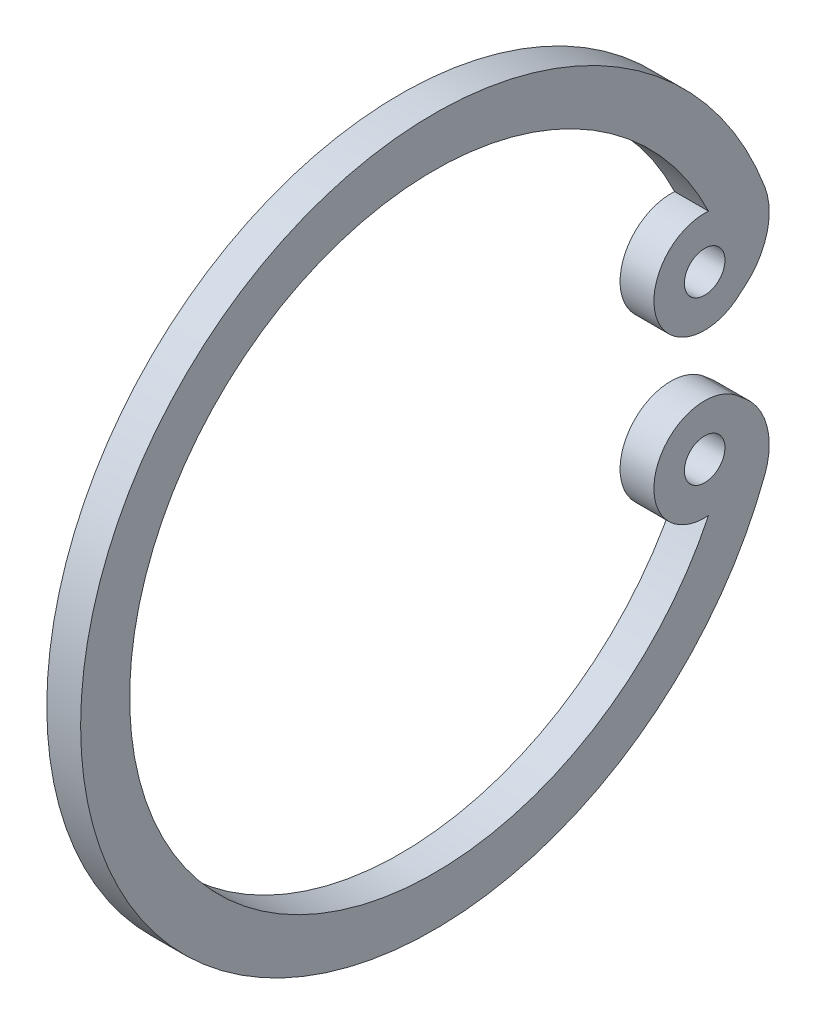
ISO-10303-21;
HEADER;
FILE_DESCRIPTION(('STEP AP214'),'2;1');
FILE_NAME('part.step','',(''),(''),'','','');
FILE_SCHEMA(('AUTOMOTIVE_DESIGN { 1 0 10303 214 1 1 1 1 }'));
ENDSEC;
DATA;
#1=APPLICATION_CONTEXT('core data for automotive mechanical design processes');
#2=APPLICATION_PROTOCOL_DEFINITION('international standard','automotive_design',2000,#1);
#3=PRODUCT_CONTEXT('',#1,'mechanical');
#4=PRODUCT('Part','Part','',(#3));
#5=PRODUCT_RELATED_PRODUCT_CATEGORY('part','',(#4));
#6=PRODUCT_DEFINITION_FORMATION('','',#4);
#7=PRODUCT_DEFINITION_CONTEXT('part definition',#1,'design');
#8=PRODUCT_DEFINITION('design','',#6,#7);
#9=PRODUCT_DEFINITION_SHAPE('','',#8);
#10=(LENGTH_UNIT() NAMED_UNIT(*) SI_UNIT(.MILLI.,.METRE.));
#11=(NAMED_UNIT(*) PLANE_ANGLE_UNIT() SI_UNIT($,.RADIAN.));
#12=(NAMED_UNIT(*) SI_UNIT($,.STERADIAN.) SOLID_ANGLE_UNIT());
#13=UNCERTAINTY_MEASURE_WITH_UNIT(LENGTH_MEASURE(1.E-05),#10,'distance_accuracy_value','');
#14=(GEOMETRIC_REPRESENTATION_CONTEXT(3) GLOBAL_UNCERTAINTY_ASSIGNED_CONTEXT((#13)) GLOBAL_UNIT_ASSIGNED_CONTEXT((#10,
#11,#12)) REPRESENTATION_CONTEXT('',''));
#15=CARTESIAN_POINT('',(0.,0.,0.));
#16=DIRECTION('',(0.,0.,1.));
#17=DIRECTION('',(1.,0.,0.));
#18=AXIS2_PLACEMENT_3D('',#15,#16,#17);
#19=CARTESIAN_POINT('',(18.3611111111111,-0.000162813210468626,9.93971753018335));
#20=DIRECTION('',(1.,0.,0.));
#21=DIRECTION('',(0.,0.,-1.));
#22=AXIS2_PLACEMENT_3D('',#19,#20,#21);
#23=CYLINDRICAL_SURFACE('',#22,2.5000000372529);
#24=CARTESIAN_POINT('',(18.6388888888889,-0.000162813210468626,9.93971753018335));
#25=DIRECTION('',(-1.,0.,0.));
#26=DIRECTION('',(0.,0.,1.));
#27=AXIS2_PLACEMENT_3D('',#24,#25,#26);
#28=CIRCLE('',#27,2.5000000372529);
#29=CARTESIAN_POINT('',(18.6388888888889,-1.08255334468496,7.68618010567962));
#30=VERTEX_POINT('',#29);
#31=CARTESIAN_POINT('',(18.6388888888889,1.08222771826402,7.68618010567962));
#32=VERTEX_POINT('',#31);
#33=EDGE_CURVE('E131',#30,#32,#28,.T.);
#34=ORIENTED_EDGE('',*,*,#33,.F.);
#35=DIRECTION('',(1.,0.,0.));
#36=VECTOR('',#35,1.);
#37=CARTESIAN_POINT('',(18.3611111111111,-1.08255334468496,7.68618010567962));
#38=LINE('',#37,#36);
#39=CARTESIAN_POINT('',(18.3611111111111,-1.08255334468496,7.68618010567962));
#40=VERTEX_POINT('',#39);
#41=EDGE_CURVE('E11',#40,#30,#38,.T.);
#42=ORIENTED_EDGE('',*,*,#41,.F.);
#43=CARTESIAN_POINT('',(18.3611111111111,-0.000162813210468626,9.93971753018335));
#44=DIRECTION('',(-1.,0.,0.));
#45=DIRECTION('',(0.,0.,1.));
#46=AXIS2_PLACEMENT_3D('',#43,#44,#45);
#47=CIRCLE('',#46,2.5000000372529);
#48=CARTESIAN_POINT('',(18.3611111111111,1.08222771826402,7.68618010567962));
#49=VERTEX_POINT('',#48);
#50=EDGE_CURVE('E152',#40,#49,#47,.T.);
#51=ORIENTED_EDGE('',*,*,#50,.T.);
#52=DIRECTION('',(1.,0.,0.));
#53=VECTOR('',#52,1.);
#54=CARTESIAN_POINT('',(18.3611111111111,1.08222771826402,7.68618010567962));
#55=LINE('',#54,#53);
#56=EDGE_CURVE('E37',#49,#32,#55,.T.);
#57=ORIENTED_EDGE('',*,*,#56,.T.);
#58=EDGE_LOOP('',(#34,#42,#51,#57));
#59=FACE_BOUND('',#58,.T.);
#60=ADVANCED_FACE('F34',(#59),#23,.F.);
#61=CARTESIAN_POINT('',(18.3611111111111,-0.666917459563021,7.71771885059295));
#62=DIRECTION('',(1.,0.,0.));
#63=DIRECTION('',(0.,0.,-1.));
#64=AXIS2_PLACEMENT_3D('',#61,#62,#63);
#65=CYLINDRICAL_SURFACE('',#64,0.416830758740048);
#66=CARTESIAN_POINT('',(18.6388888888889,-0.666917459563021,7.71771885059295));
#67=DIRECTION('',(1.,0.,0.));
#68=DIRECTION('',(0.,0.,-1.));
#69=AXIS2_PLACEMENT_3D('',#66,#67,#68);
#70=CIRCLE('',#69,0.416830758740048);
#71=CARTESIAN_POINT('',(18.6388888888889,-0.337229909778591,7.46266199232613));
#72=VERTEX_POINT('',#71);
#73=EDGE_CURVE('E150',#72,#30,#70,.T.);
#74=ORIENTED_EDGE('',*,*,#73,.F.);
#75=DIRECTION('',(1.,0.,0.));
#76=VECTOR('',#75,1.);
#77=CARTESIAN_POINT('',(18.3611111111111,-0.337229909778591,7.46266199232613));
#78=LINE('',#77,#76);
#79=CARTESIAN_POINT('',(18.3611111111111,-0.337229909778591,7.46266199232613));
#80=VERTEX_POINT('',#79);
#81=EDGE_CURVE('E43',#80,#72,#78,.T.);
#82=ORIENTED_EDGE('',*,*,#81,.F.);
#83=CARTESIAN_POINT('',(18.3611111111111,-0.666917459563021,7.71771885059295));
#84=DIRECTION('',(1.,0.,0.));
#85=DIRECTION('',(0.,0.,-1.));
#86=AXIS2_PLACEMENT_3D('',#83,#84,#85);
#87=CIRCLE('',#86,0.416830758740048);
#88=EDGE_CURVE('E121',#80,#40,#87,.T.);
#89=ORIENTED_EDGE('',*,*,#88,.T.);
#90=ORIENTED_EDGE('',*,*,#41,.T.);
#91=EDGE_LOOP('',(#74,#82,#89,#90));
#92=FACE_BOUND('',#91,.T.);
#93=ADVANCED_FACE('F164',(#92),#65,.T.);
#94=CARTESIAN_POINT('',(18.3611111111111,-0.401543008719923,7.38601662561192));
#95=DIRECTION('',(0.,0.766044443118982,-0.642787609686534));
#96=DIRECTION('',(0.,0.642787609686534,0.766044443118982));
#97=AXIS2_PLACEMENT_3D('',#94,#95,#96);
#98=PLANE('',#97);
#99=DIRECTION('',(0.,0.642787609686534,0.766044443118982));
#100=VECTOR('',#99,1.);
#101=CARTESIAN_POINT('',(18.6388888888889,-0.401543008719923,7.38601662561192));
#102=LINE('',#101,#100);
#103=CARTESIAN_POINT('',(18.6388888888889,-0.401543008719923,7.38601662561192));
#104=VERTEX_POINT('',#103);
#105=EDGE_CURVE('E108',#104,#72,#102,.T.);
#106=ORIENTED_EDGE('',*,*,#105,.F.);
#107=DIRECTION('',(1.,0.,0.));
#108=VECTOR('',#107,1.);
#109=CARTESIAN_POINT('',(18.3611111111111,-0.401543008719923,7.38601662561192));
#110=LINE('',#109,#108);
#111=CARTESIAN_POINT('',(18.3611111111111,-0.401543008719923,7.38601662561192));
#112=VERTEX_POINT('',#111);
#113=EDGE_CURVE('E103',#112,#104,#110,.T.);
#114=ORIENTED_EDGE('',*,*,#113,.F.);
#115=DIRECTION('',(0.,0.642787609686534,0.766044443118982));
#116=VECTOR('',#115,1.);
#117=CARTESIAN_POINT('',(18.3611111111111,-0.401543008719923,7.38601662561192));
#118=LINE('',#117,#116);
#119=EDGE_CURVE('E106',#112,#80,#118,.T.);
#120=ORIENTED_EDGE('',*,*,#119,.T.);
#121=ORIENTED_EDGE('',*,*,#81,.T.);
#122=EDGE_LOOP('',(#106,#114,#120,#121));
#123=FACE_BOUND('',#122,.T.);
#124=ADVANCED_FACE('F105',(#123),#98,.T.);
#125=CARTESIAN_POINT('',(18.3611111111111,-0.827123254897134,7.74312085321556));
#126=DIRECTION('',(1.,0.,0.));
#127=DIRECTION('',(0.,0.,-1.));
#128=AXIS2_PLACEMENT_3D('',#125,#126,#127);
#129=CYLINDRICAL_SURFACE('',#128,0.555555555555558);
#130=CARTESIAN_POINT('',(18.6388888888889,-0.827123254897134,7.74312085321556));
#131=DIRECTION('',(1.,0.,0.));
#132=DIRECTION('',(0.,0.,-1.));
#133=AXIS2_PLACEMENT_3D('',#130,#131,#132);
#134=CIRCLE('',#133,0.555555555555558);
#135=CARTESIAN_POINT('',(18.6388888888889,-1.02286333631576,7.22319028493276));
#136=VERTEX_POINT('',#135);
#137=EDGE_CURVE('E147',#136,#104,#134,.T.);
#138=ORIENTED_EDGE('',*,*,#137,.F.);
#139=DIRECTION('',(1.,0.,0.));
#140=VECTOR('',#139,1.);
#141=CARTESIAN_POINT('',(18.3611111111111,-1.02286333631576,7.22319028493276));
#142=LINE('',#141,#140);
#143=CARTESIAN_POINT('',(18.3611111111111,-1.02286333631576,7.22319028493276));
#144=VERTEX_POINT('',#143);
#145=EDGE_CURVE('E113',#144,#136,#142,.T.);
#146=ORIENTED_EDGE('',*,*,#145,.F.);
#147=CARTESIAN_POINT('',(18.3611111111111,-0.827123254897134,7.74312085321556));
#148=DIRECTION('',(1.,0.,0.));
#149=DIRECTION('',(0.,0.,-1.));
#150=AXIS2_PLACEMENT_3D('',#147,#148,#149);
#151=CIRCLE('',#150,0.555555555555558);
#152=EDGE_CURVE('E119',#144,#112,#151,.T.);
#153=ORIENTED_EDGE('',*,*,#152,.T.);
#154=ORIENTED_EDGE('',*,*,#113,.T.);
#155=EDGE_LOOP('',(#138,#146,#153,#154));
#156=FACE_BOUND('',#155,.T.);
#157=ADVANCED_FACE('F123',(#156),#129,.T.);
#158=CARTESIAN_POINT('',(18.3611111111111,-0.000162813210468626,9.93971753018335));
#159=DIRECTION('',(1.,0.,0.));
#160=DIRECTION('',(0.,0.,-1.));
#161=AXIS2_PLACEMENT_3D('',#158,#159,#160);
#162=CYLINDRICAL_SURFACE('',#161,2.90266026846901);
#163=CARTESIAN_POINT('',(18.6388888888889,-0.000162813210468626,9.93971753018335));
#164=DIRECTION('',(1.,0.,0.));
#165=DIRECTION('',(0.,0.,-1.));
#166=AXIS2_PLACEMENT_3D('',#163,#164,#165);
#167=CIRCLE('',#166,2.90266026846901);
#168=CARTESIAN_POINT('',(18.6388888888889,1.0225283518045,7.22318676187813));
#169=VERTEX_POINT('',#168);
#170=EDGE_CURVE('E144',#169,#136,#167,.T.);
#171=ORIENTED_EDGE('',*,*,#170,.F.);
#172=DIRECTION('',(1.,0.,0.));
#173=VECTOR('',#172,1.);
#174=CARTESIAN_POINT('',(18.3611111111111,1.0225283518045,7.22318676187813));
#175=LINE('',#174,#173);
#176=CARTESIAN_POINT('',(18.3611111111111,1.0225283518045,7.22318676187813));
#177=VERTEX_POINT('',#176);
#178=EDGE_CURVE('E156',#177,#169,#175,.T.);
#179=ORIENTED_EDGE('',*,*,#178,.F.);
#180=CARTESIAN_POINT('',(18.3611111111111,-0.000162813210468626,9.93971753018335));
#181=DIRECTION('',(1.,0.,0.));
#182=DIRECTION('',(0.,0.,-1.));
#183=AXIS2_PLACEMENT_3D('',#180,#181,#182);
#184=CIRCLE('',#183,2.90266026846901);
#185=EDGE_CURVE('E124',#177,#144,#184,.T.);
#186=ORIENTED_EDGE('',*,*,#185,.T.);
#187=ORIENTED_EDGE('',*,*,#145,.T.);
#188=EDGE_LOOP('',(#171,#179,#186,#187));
#189=FACE_BOUND('',#188,.T.);
#190=ADVANCED_FACE('F177',(#189),#162,.T.);
#191=CARTESIAN_POINT('',(18.3611111111111,0.826790061480457,7.74311800445706));
#192=DIRECTION('',(1.,0.,0.));
#193=DIRECTION('',(0.,0.,-1.));
#194=AXIS2_PLACEMENT_3D('',#191,#192,#193);
#195=CYLINDRICAL_SURFACE('',#194,0.555555555555555);
#196=CARTESIAN_POINT('',(18.6388888888889,0.826790061480457,7.74311800445706));
#197=DIRECTION('',(1.,0.,0.));
#198=DIRECTION('',(0.,0.,-1.));
#199=AXIS2_PLACEMENT_3D('',#196,#197,#198);
#200=CIRCLE('',#199,0.555555555555555);
#201=CARTESIAN_POINT('',(18.6388888888889,0.401209815303247,7.38601377685343));
#202=VERTEX_POINT('',#201);
#203=EDGE_CURVE('E141',#202,#169,#200,.T.);
#204=ORIENTED_EDGE('',*,*,#203,.F.);
#205=DIRECTION('',(1.,0.,0.));
#206=VECTOR('',#205,1.);
#207=CARTESIAN_POINT('',(18.3611111111111,0.401209815303247,7.38601377685343));
#208=LINE('',#207,#206);
#209=CARTESIAN_POINT('',(18.3611111111111,0.401209815303247,7.38601377685343));
#210=VERTEX_POINT('',#209);
#211=EDGE_CURVE('E158',#210,#202,#208,.T.);
#212=ORIENTED_EDGE('',*,*,#211,.F.);
#213=CARTESIAN_POINT('',(18.3611111111111,0.826790061480457,7.74311800445706));
#214=DIRECTION('',(1.,0.,0.));
#215=DIRECTION('',(0.,0.,-1.));
#216=AXIS2_PLACEMENT_3D('',#213,#214,#215);
#217=CIRCLE('',#216,0.555555555555555);
#218=EDGE_CURVE('E126',#210,#177,#217,.T.);
#219=ORIENTED_EDGE('',*,*,#218,.T.);
#220=ORIENTED_EDGE('',*,*,#178,.T.);
#221=EDGE_LOOP('',(#204,#212,#219,#220));
#222=FACE_BOUND('',#221,.T.);
#223=ADVANCED_FACE('F180',(#222),#195,.T.);
#224=CARTESIAN_POINT('',(18.3611111111111,0.337156289867929,7.46285995798236));
#225=DIRECTION('',(0.,-0.768147331821205,-0.640273126576435));
#226=DIRECTION('',(0.,0.640273126576435,-0.768147331821205));
#227=AXIS2_PLACEMENT_3D('',#224,#225,#226);
#228=PLANE('',#227);
#229=DIRECTION('',(0.,0.640273126576435,-0.768147331821205));
#230=VECTOR('',#229,1.);
#231=CARTESIAN_POINT('',(18.6388888888889,0.337156289867929,7.46285995798236));
#232=LINE('',#231,#230);
#233=CARTESIAN_POINT('',(18.6388888888889,0.337156289867929,7.46285995798236));
#234=VERTEX_POINT('',#233);
#235=EDGE_CURVE('E138',#234,#202,#232,.T.);
#236=ORIENTED_EDGE('',*,*,#235,.F.);
#237=DIRECTION('',(1.,0.,0.));
#238=VECTOR('',#237,1.);
#239=CARTESIAN_POINT('',(18.3611111111111,0.337156289867929,7.46285995798236));
#240=LINE('',#239,#238);
#241=CARTESIAN_POINT('',(18.3611111111111,0.337156289867929,7.46285995798236));
#242=VERTEX_POINT('',#241);
#243=EDGE_CURVE('E159',#242,#234,#240,.T.);
#244=ORIENTED_EDGE('',*,*,#243,.F.);
#245=DIRECTION('',(0.,0.640273126576435,-0.768147331821205));
#246=VECTOR('',#245,1.);
#247=CARTESIAN_POINT('',(18.3611111111111,0.337156289867929,7.46285995798236));
#248=LINE('',#247,#246);
#249=EDGE_CURVE('E226',#242,#210,#248,.T.);
#250=ORIENTED_EDGE('',*,*,#249,.T.);
#251=ORIENTED_EDGE('',*,*,#211,.T.);
#252=EDGE_LOOP('',(#236,#244,#250,#251));
#253=FACE_BOUND('',#252,.T.);
#254=ADVANCED_FACE('F184',(#253),#228,.T.);
#255=CARTESIAN_POINT('',(18.3611111111111,0.666759358402729,7.71775783620726));
#256=DIRECTION('',(1.,0.,0.));
#257=DIRECTION('',(0.,0.,-1.));
#258=AXIS2_PLACEMENT_3D('',#255,#256,#257);
#259=CYLINDRICAL_SURFACE('',#258,0.416666666666666);
#260=CARTESIAN_POINT('',(18.6388888888889,0.666759358402729,7.71775783620726));
#261=DIRECTION('',(1.,0.,0.));
#262=DIRECTION('',(0.,0.,-1.));
#263=AXIS2_PLACEMENT_3D('',#260,#261,#262);
#264=CIRCLE('',#263,0.416666666666666);
#265=EDGE_CURVE('E134',#32,#234,#264,.T.);
#266=ORIENTED_EDGE('',*,*,#265,.F.);
#267=ORIENTED_EDGE('',*,*,#56,.F.);
#268=CARTESIAN_POINT('',(18.3611111111111,0.666759358402729,7.71775783620726));
#269=DIRECTION('',(1.,0.,0.));
#270=DIRECTION('',(0.,0.,-1.));
#271=AXIS2_PLACEMENT_3D('',#268,#269,#270);
#272=CIRCLE('',#271,0.416666666666666);
#273=EDGE_CURVE('E224',#49,#242,#272,.T.);
#274=ORIENTED_EDGE('',*,*,#273,.T.);
#275=ORIENTED_EDGE('',*,*,#243,.T.);
#276=EDGE_LOOP('',(#266,#267,#274,#275));
#277=FACE_BOUND('',#276,.T.);
#278=ADVANCED_FACE('F161',(#277),#259,.T.);
#279=CARTESIAN_POINT('',(18.3611111111111,-0.000162813210468626,9.93971753018335));
#280=DIRECTION('',(-1.,0.,0.));
#281=DIRECTION('',(0.,0.,1.));
#282=AXIS2_PLACEMENT_3D('',#279,#280,#281);
#283=PLANE('',#282);
#284=CARTESIAN_POINT('',(18.3611111111111,0.66653768838861,7.71760813916771));
#285=DIRECTION('',(1.,0.,0.));
#286=DIRECTION('',(0.,0.,1.));
#287=AXIS2_PLACEMENT_3D('',#284,#285,#286);
#288=CIRCLE('',#287,0.166666666666667);
#289=CARTESIAN_POINT('',(18.3611111111111,0.66653768838861,7.88427480583437));
#290=VERTEX_POINT('',#289);
#291=EDGE_CURVE('E211',#290,#290,#288,.T.);
#292=ORIENTED_EDGE('',*,*,#291,.T.);
#293=EDGE_LOOP('',(#292));
#294=FACE_BOUND('',#293,.T.);
#295=CARTESIAN_POINT('',(18.3611111111111,-0.666795644944723,7.71760813916771));
#296=DIRECTION('',(1.,0.,0.));
#297=DIRECTION('',(0.,0.,1.));
#298=AXIS2_PLACEMENT_3D('',#295,#296,#297);
#299=CIRCLE('',#298,0.166666666666667);
#300=CARTESIAN_POINT('',(18.3611111111111,-0.666795644944723,7.88427480583437));
#301=VERTEX_POINT('',#300);
#302=EDGE_CURVE('E135',#301,#301,#299,.T.);
#303=ORIENTED_EDGE('',*,*,#302,.T.);
#304=EDGE_LOOP('',(#303));
#305=FACE_BOUND('',#304,.T.);
#306=ORIENTED_EDGE('',*,*,#50,.F.);
#307=ORIENTED_EDGE('',*,*,#88,.F.);
#308=ORIENTED_EDGE('',*,*,#119,.F.);
#309=ORIENTED_EDGE('',*,*,#152,.F.);
#310=ORIENTED_EDGE('',*,*,#185,.F.);
#311=ORIENTED_EDGE('',*,*,#218,.F.);
#312=ORIENTED_EDGE('',*,*,#249,.F.);
#313=ORIENTED_EDGE('',*,*,#273,.F.);
#314=EDGE_LOOP('',(#306,#307,#308,#309,#310,#311,#312,#313));
#315=FACE_BOUND('',#314,.T.);
#316=ADVANCED_FACE('F117',(#294,#305,#315),#283,.T.);
#317=CARTESIAN_POINT('',(18.6388888888889,-0.000162813210468626,9.93971753018335));
#318=DIRECTION('',(-1.,0.,0.));
#319=DIRECTION('',(0.,0.,1.));
#320=AXIS2_PLACEMENT_3D('',#317,#318,#319);
#321=PLANE('',#320);
#322=CARTESIAN_POINT('',(18.6388888888889,0.66653768838861,7.71760813916771));
#323=DIRECTION('',(1.,0.,0.));
#324=DIRECTION('',(0.,0.,1.));
#325=AXIS2_PLACEMENT_3D('',#322,#323,#324);
#326=CIRCLE('',#325,0.166666666666667);
#327=CARTESIAN_POINT('',(18.6388888888889,0.66653768838861,7.88427480583437));
#328=VERTEX_POINT('',#327);
#329=EDGE_CURVE('E214',#328,#328,#326,.T.);
#330=ORIENTED_EDGE('',*,*,#329,.F.);
#331=EDGE_LOOP('',(#330));
#332=FACE_BOUND('',#331,.T.);
#333=CARTESIAN_POINT('',(18.6388888888889,-0.666795644944723,7.71760813916771));
#334=DIRECTION('',(1.,0.,0.));
#335=DIRECTION('',(0.,0.,1.));
#336=AXIS2_PLACEMENT_3D('',#333,#334,#335);
#337=CIRCLE('',#336,0.166666666666667);
#338=CARTESIAN_POINT('',(18.6388888888889,-0.666795644944723,7.88427480583437));
#339=VERTEX_POINT('',#338);
#340=EDGE_CURVE('E216',#339,#339,#337,.T.);
#341=ORIENTED_EDGE('',*,*,#340,.F.);
#342=EDGE_LOOP('',(#341));
#343=FACE_BOUND('',#342,.T.);
#344=ORIENTED_EDGE('',*,*,#33,.T.);
#345=ORIENTED_EDGE('',*,*,#265,.T.);
#346=ORIENTED_EDGE('',*,*,#235,.T.);
#347=ORIENTED_EDGE('',*,*,#203,.T.);
#348=ORIENTED_EDGE('',*,*,#170,.T.);
#349=ORIENTED_EDGE('',*,*,#137,.T.);
#350=ORIENTED_EDGE('',*,*,#105,.T.);
#351=ORIENTED_EDGE('',*,*,#73,.T.);
#352=EDGE_LOOP('',(#344,#345,#346,#347,#348,#349,#350,#351));
#353=FACE_BOUND('',#352,.T.);
#354=ADVANCED_FACE('F163',(#332,#343,#353),#321,.F.);
#355=CARTESIAN_POINT('',(18.3611111111111,-0.666795644944723,7.71760813916771));
#356=DIRECTION('',(1.,0.,0.));
#357=DIRECTION('',(0.,0.,-1.));
#358=AXIS2_PLACEMENT_3D('',#355,#356,#357);
#359=CYLINDRICAL_SURFACE('',#358,0.166666666666667);
#360=ORIENTED_EDGE('',*,*,#302,.F.);
#361=EDGE_LOOP('',(#360));
#362=FACE_BOUND('',#361,.T.);
#363=ORIENTED_EDGE('',*,*,#340,.T.);
#364=EDGE_LOOP('',(#363));
#365=FACE_BOUND('',#364,.T.);
#366=ADVANCED_FACE('F196',(#362,#365),#359,.F.);
#367=CARTESIAN_POINT('',(18.3611111111111,0.66653768838861,7.71760813916771));
#368=DIRECTION('',(1.,0.,0.));
#369=DIRECTION('',(0.,0.,-1.));
#370=AXIS2_PLACEMENT_3D('',#367,#368,#369);
#371=CYLINDRICAL_SURFACE('',#370,0.166666666666667);
#372=ORIENTED_EDGE('',*,*,#291,.F.);
#373=EDGE_LOOP('',(#372));
#374=FACE_BOUND('',#373,.T.);
#375=ORIENTED_EDGE('',*,*,#329,.T.);
#376=EDGE_LOOP('',(#375));
#377=FACE_BOUND('',#376,.T.);
#378=ADVANCED_FACE('F203',(#374,#377),#371,.F.);
#379=CLOSED_SHELL('',(#60,#93,#124,#157,#190,#223,#254,#278,#316,#354,#366,#378));
#380=MANIFOLD_SOLID_BREP('B2',#379);
#381=ADVANCED_BREP_SHAPE_REPRESENTATION('',(#18,#380),#14);
#382=SHAPE_DEFINITION_REPRESENTATION(#9,#381);
ENDSEC;
END-ISO-10303-21;
